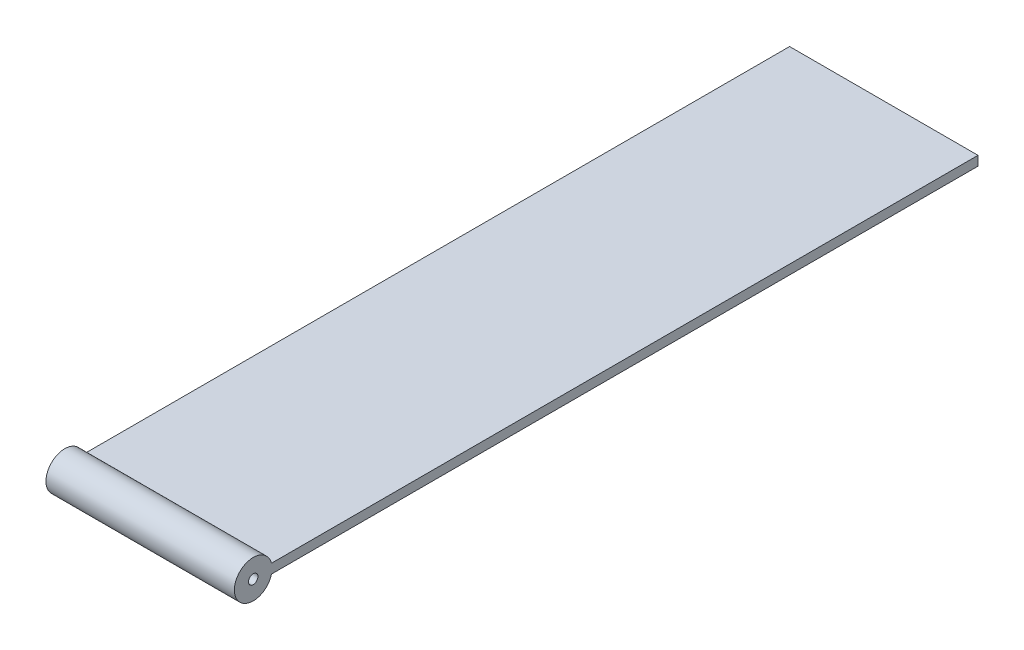
ISO-10303-21;
HEADER;
FILE_DESCRIPTION(('STEP AP214'),'2;1');
FILE_NAME('part.step','',(''),(''),'','','');
FILE_SCHEMA(('AUTOMOTIVE_DESIGN { 1 0 10303 214 1 1 1 1 }'));
ENDSEC;
DATA;
#1=APPLICATION_CONTEXT('core data for automotive mechanical design processes');
#2=APPLICATION_PROTOCOL_DEFINITION('international standard','automotive_design',2000,#1);
#3=PRODUCT_CONTEXT('',#1,'mechanical');
#4=PRODUCT('Part','Part','',(#3));
#5=PRODUCT_RELATED_PRODUCT_CATEGORY('part','',(#4));
#6=PRODUCT_DEFINITION_FORMATION('','',#4);
#7=PRODUCT_DEFINITION_CONTEXT('part definition',#1,'design');
#8=PRODUCT_DEFINITION('design','',#6,#7);
#9=PRODUCT_DEFINITION_SHAPE('','',#8);
#10=(LENGTH_UNIT() NAMED_UNIT(*) SI_UNIT(.MILLI.,.METRE.));
#11=(NAMED_UNIT(*) PLANE_ANGLE_UNIT() SI_UNIT($,.RADIAN.));
#12=(NAMED_UNIT(*) SI_UNIT($,.STERADIAN.) SOLID_ANGLE_UNIT());
#13=UNCERTAINTY_MEASURE_WITH_UNIT(LENGTH_MEASURE(1.E-05),#10,'distance_accuracy_value','');
#14=(GEOMETRIC_REPRESENTATION_CONTEXT(3) GLOBAL_UNCERTAINTY_ASSIGNED_CONTEXT((#13)) GLOBAL_UNIT_ASSIGNED_CONTEXT((#10,
#11,#12)) REPRESENTATION_CONTEXT('',''));
#15=CARTESIAN_POINT('',(0.,0.,0.));
#16=DIRECTION('',(0.,0.,1.));
#17=DIRECTION('',(1.,0.,0.));
#18=AXIS2_PLACEMENT_3D('',#15,#16,#17);
#19=CARTESIAN_POINT('',(-20.,1.,0.));
#20=DIRECTION('',(0.,-1.,0.));
#21=DIRECTION('',(0.,0.,-1.));
#22=AXIS2_PLACEMENT_3D('',#19,#20,#21);
#23=PLANE('',#22);
#24=DIRECTION('',(1.,0.,0.));
#25=VECTOR('',#24,1.);
#26=CARTESIAN_POINT('',(-20.,1.,18.972354405693));
#27=LINE('',#26,#25);
#28=CARTESIAN_POINT('',(-20.,1.,18.972354405693));
#29=VERTEX_POINT('',#28);
#30=CARTESIAN_POINT('',(20.,1.,18.972354405693));
#31=VERTEX_POINT('',#30);
#32=EDGE_CURVE('E50',#29,#31,#27,.T.);
#33=ORIENTED_EDGE('',*,*,#32,.T.);
#34=DIRECTION('',(0.,0.,-1.));
#35=VECTOR('',#34,1.);
#36=CARTESIAN_POINT('',(20.,1.,0.));
#37=LINE('',#36,#35);
#38=CARTESIAN_POINT('',(20.,1.,-131.027645594307));
#39=VERTEX_POINT('',#38);
#40=EDGE_CURVE('E89',#31,#39,#37,.T.);
#41=ORIENTED_EDGE('',*,*,#40,.T.);
#42=DIRECTION('',(1.,0.,0.));
#43=VECTOR('',#42,1.);
#44=CARTESIAN_POINT('',(-20.,1.,-131.027645594307));
#45=LINE('',#44,#43);
#46=CARTESIAN_POINT('',(-20.,1.,-131.027645594307));
#47=VERTEX_POINT('',#46);
#48=EDGE_CURVE('E13',#47,#39,#45,.T.);
#49=ORIENTED_EDGE('',*,*,#48,.F.);
#50=DIRECTION('',(0.,0.,-1.));
#51=VECTOR('',#50,1.);
#52=CARTESIAN_POINT('',(-20.,1.,0.));
#53=LINE('',#52,#51);
#54=EDGE_CURVE('E91',#29,#47,#53,.T.);
#55=ORIENTED_EDGE('',*,*,#54,.F.);
#56=EDGE_LOOP('',(#33,#41,#49,#55));
#57=FACE_BOUND('',#56,.T.);
#58=ADVANCED_FACE('F47',(#57),#23,.F.);
#59=CARTESIAN_POINT('',(-20.,0.,-131.027645594307));
#60=DIRECTION('',(0.,0.,1.));
#61=DIRECTION('',(1.,0.,0.));
#62=AXIS2_PLACEMENT_3D('',#59,#60,#61);
#63=PLANE('',#62);
#64=ORIENTED_EDGE('',*,*,#48,.T.);
#65=DIRECTION('',(0.,-1.,0.));
#66=VECTOR('',#65,1.);
#67=CARTESIAN_POINT('',(20.,0.,-131.027645594307));
#68=LINE('',#67,#66);
#69=CARTESIAN_POINT('',(20.,-0.999999999999999,-131.027645594307));
#70=VERTEX_POINT('',#69);
#71=EDGE_CURVE('E108',#39,#70,#68,.T.);
#72=ORIENTED_EDGE('',*,*,#71,.T.);
#73=DIRECTION('',(1.,0.,0.));
#74=VECTOR('',#73,1.);
#75=CARTESIAN_POINT('',(-20.,-0.999999999999999,-131.027645594307));
#76=LINE('',#75,#74);
#77=CARTESIAN_POINT('',(-20.,-0.999999999999999,-131.027645594307));
#78=VERTEX_POINT('',#77);
#79=EDGE_CURVE('E55',#78,#70,#76,.T.);
#80=ORIENTED_EDGE('',*,*,#79,.F.);
#81=DIRECTION('',(0.,-1.,0.));
#82=VECTOR('',#81,1.);
#83=CARTESIAN_POINT('',(-20.,0.,-131.027645594307));
#84=LINE('',#83,#82);
#85=EDGE_CURVE('E62',#47,#78,#84,.T.);
#86=ORIENTED_EDGE('',*,*,#85,.F.);
#87=EDGE_LOOP('',(#64,#72,#80,#86));
#88=FACE_BOUND('',#87,.T.);
#89=ADVANCED_FACE('F127',(#88),#63,.F.);
#90=CARTESIAN_POINT('',(-20.,-1.,0.));
#91=DIRECTION('',(0.,-1.,0.));
#92=DIRECTION('',(0.,0.,-1.));
#93=AXIS2_PLACEMENT_3D('',#90,#91,#92);
#94=PLANE('',#93);
#95=ORIENTED_EDGE('',*,*,#79,.T.);
#96=DIRECTION('',(0.,0.,-1.));
#97=VECTOR('',#96,1.);
#98=CARTESIAN_POINT('',(20.,-1.,0.));
#99=LINE('',#98,#97);
#100=CARTESIAN_POINT('',(20.,-1.,18.972354405693));
#101=VERTEX_POINT('',#100);
#102=EDGE_CURVE('E103',#101,#70,#99,.T.);
#103=ORIENTED_EDGE('',*,*,#102,.F.);
#104=DIRECTION('',(1.,0.,0.));
#105=VECTOR('',#104,1.);
#106=CARTESIAN_POINT('',(-20.,-1.,18.972354405693));
#107=LINE('',#106,#105);
#108=CARTESIAN_POINT('',(-20.,-1.,18.972354405693));
#109=VERTEX_POINT('',#108);
#110=EDGE_CURVE('E95',#109,#101,#107,.T.);
#111=ORIENTED_EDGE('',*,*,#110,.F.);
#112=DIRECTION('',(0.,0.,-1.));
#113=VECTOR('',#112,1.);
#114=CARTESIAN_POINT('',(-20.,-1.,0.));
#115=LINE('',#114,#113);
#116=EDGE_CURVE('E119',#109,#78,#115,.T.);
#117=ORIENTED_EDGE('',*,*,#116,.T.);
#118=EDGE_LOOP('',(#95,#103,#111,#117));
#119=FACE_BOUND('',#118,.T.);
#120=ADVANCED_FACE('F126',(#119),#94,.T.);
#121=CARTESIAN_POINT('',(-20.,0.,22.8453377519005));
#122=DIRECTION('',(1.,0.,0.));
#123=DIRECTION('',(0.,0.,-1.));
#124=AXIS2_PLACEMENT_3D('',#121,#122,#123);
#125=CYLINDRICAL_SURFACE('',#124,4.);
#126=ORIENTED_EDGE('',*,*,#110,.T.);
#127=CARTESIAN_POINT('',(20.,0.,22.8453377519005));
#128=DIRECTION('',(1.,0.,0.));
#129=DIRECTION('',(0.,0.,-1.));
#130=AXIS2_PLACEMENT_3D('',#127,#128,#129);
#131=CIRCLE('',#130,4.);
#132=EDGE_CURVE('E98',#31,#101,#131,.T.);
#133=ORIENTED_EDGE('',*,*,#132,.F.);
#134=ORIENTED_EDGE('',*,*,#32,.F.);
#135=CARTESIAN_POINT('',(-20.,0.,22.8453377519005));
#136=DIRECTION('',(1.,0.,0.));
#137=DIRECTION('',(0.,0.,-1.));
#138=AXIS2_PLACEMENT_3D('',#135,#136,#137);
#139=CIRCLE('',#138,4.);
#140=EDGE_CURVE('E117',#29,#109,#139,.T.);
#141=ORIENTED_EDGE('',*,*,#140,.T.);
#142=EDGE_LOOP('',(#126,#133,#134,#141));
#143=FACE_BOUND('',#142,.T.);
#144=ADVANCED_FACE('F99',(#143),#125,.T.);
#145=CARTESIAN_POINT('',(-20.,0.,22.8453377519005));
#146=DIRECTION('',(1.,0.,0.));
#147=DIRECTION('',(0.,0.,-1.));
#148=AXIS2_PLACEMENT_3D('',#145,#146,#147);
#149=CYLINDRICAL_SURFACE('',#148,1.);
#150=CARTESIAN_POINT('',(-20.,0.,22.8453377519005));
#151=DIRECTION('',(1.,0.,0.));
#152=DIRECTION('',(0.,0.,-1.));
#153=AXIS2_PLACEMENT_3D('',#150,#151,#152);
#154=CIRCLE('',#153,1.);
#155=CARTESIAN_POINT('',(-20.,0.,21.8453377519005));
#156=VERTEX_POINT('',#155);
#157=EDGE_CURVE('E96',#156,#156,#154,.T.);
#158=ORIENTED_EDGE('',*,*,#157,.F.);
#159=EDGE_LOOP('',(#158));
#160=FACE_BOUND('',#159,.T.);
#161=CARTESIAN_POINT('',(20.,0.,22.8453377519005));
#162=DIRECTION('',(1.,0.,0.));
#163=DIRECTION('',(0.,0.,-1.));
#164=AXIS2_PLACEMENT_3D('',#161,#162,#163);
#165=CIRCLE('',#164,1.);
#166=CARTESIAN_POINT('',(20.,0.,21.8453377519005));
#167=VERTEX_POINT('',#166);
#168=EDGE_CURVE('E113',#167,#167,#165,.T.);
#169=ORIENTED_EDGE('',*,*,#168,.T.);
#170=EDGE_LOOP('',(#169));
#171=FACE_BOUND('',#170,.T.);
#172=ADVANCED_FACE('F136',(#160,#171),#149,.F.);
#173=CARTESIAN_POINT('',(-20.,0.,0.));
#174=DIRECTION('',(1.,0.,0.));
#175=DIRECTION('',(0.,0.,-1.));
#176=AXIS2_PLACEMENT_3D('',#173,#174,#175);
#177=PLANE('',#176);
#178=ORIENTED_EDGE('',*,*,#54,.T.);
#179=ORIENTED_EDGE('',*,*,#85,.T.);
#180=ORIENTED_EDGE('',*,*,#116,.F.);
#181=ORIENTED_EDGE('',*,*,#140,.F.);
#182=EDGE_LOOP('',(#178,#179,#180,#181));
#183=FACE_BOUND('',#182,.T.);
#184=ORIENTED_EDGE('',*,*,#157,.T.);
#185=EDGE_LOOP('',(#184));
#186=FACE_BOUND('',#185,.T.);
#187=ADVANCED_FACE('F142',(#183,#186),#177,.F.);
#188=CARTESIAN_POINT('',(20.,0.,0.));
#189=DIRECTION('',(1.,0.,0.));
#190=DIRECTION('',(0.,0.,-1.));
#191=AXIS2_PLACEMENT_3D('',#188,#189,#190);
#192=PLANE('',#191);
#193=ORIENTED_EDGE('',*,*,#40,.F.);
#194=ORIENTED_EDGE('',*,*,#132,.T.);
#195=ORIENTED_EDGE('',*,*,#102,.T.);
#196=ORIENTED_EDGE('',*,*,#71,.F.);
#197=EDGE_LOOP('',(#193,#194,#195,#196));
#198=FACE_BOUND('',#197,.T.);
#199=ORIENTED_EDGE('',*,*,#168,.F.);
#200=EDGE_LOOP('',(#199));
#201=FACE_BOUND('',#200,.T.);
#202=ADVANCED_FACE('F105',(#198,#201),#192,.T.);
#203=CLOSED_SHELL('',(#58,#89,#120,#144,#172,#187,#202));
#204=MANIFOLD_SOLID_BREP('B2',#203);
#205=ADVANCED_BREP_SHAPE_REPRESENTATION('',(#18,#204),#14);
#206=SHAPE_DEFINITION_REPRESENTATION(#9,#205);
ENDSEC;
END-ISO-10303-21;
